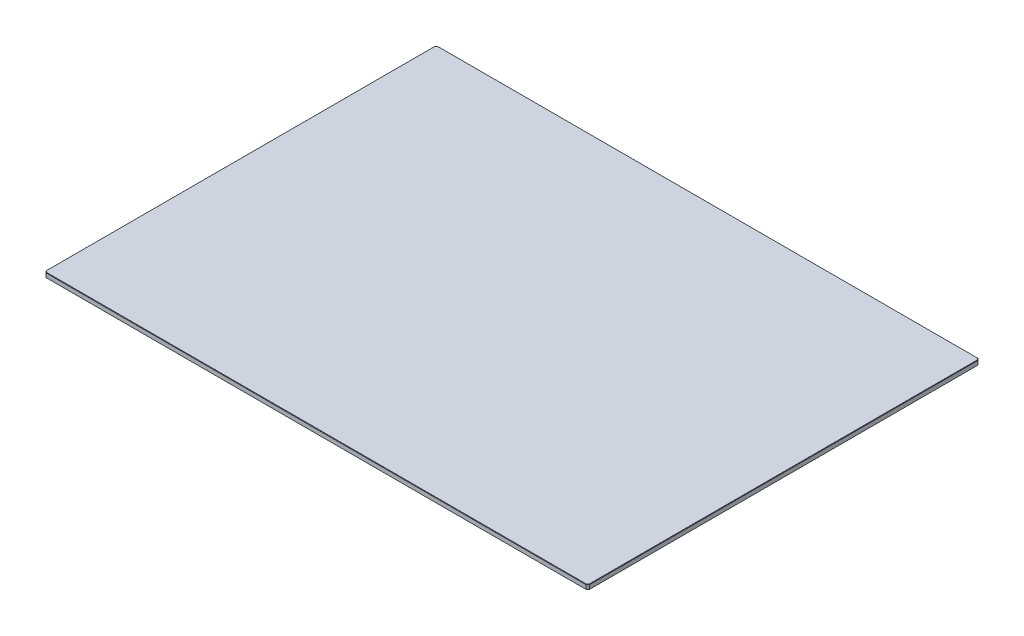
ISO-10303-21;
HEADER;
FILE_DESCRIPTION(('STEP AP214'),'2;1');
FILE_NAME('part.step','',(''),(''),'','','');
FILE_SCHEMA(('AUTOMOTIVE_DESIGN { 1 0 10303 214 1 1 1 1 }'));
ENDSEC;
DATA;
#1=APPLICATION_CONTEXT('core data for automotive mechanical design processes');
#2=APPLICATION_PROTOCOL_DEFINITION('international standard','automotive_design',2000,#1);
#3=PRODUCT_CONTEXT('',#1,'mechanical');
#4=PRODUCT('Part','Part','',(#3));
#5=PRODUCT_RELATED_PRODUCT_CATEGORY('part','',(#4));
#6=PRODUCT_DEFINITION_FORMATION('','',#4);
#7=PRODUCT_DEFINITION_CONTEXT('part definition',#1,'design');
#8=PRODUCT_DEFINITION('design','',#6,#7);
#9=PRODUCT_DEFINITION_SHAPE('','',#8);
#10=(LENGTH_UNIT() NAMED_UNIT(*) SI_UNIT(.MILLI.,.METRE.));
#11=(NAMED_UNIT(*) PLANE_ANGLE_UNIT() SI_UNIT($,.RADIAN.));
#12=(NAMED_UNIT(*) SI_UNIT($,.STERADIAN.) SOLID_ANGLE_UNIT());
#13=UNCERTAINTY_MEASURE_WITH_UNIT(LENGTH_MEASURE(1.E-05),#10,'distance_accuracy_value','');
#14=(GEOMETRIC_REPRESENTATION_CONTEXT(3) GLOBAL_UNCERTAINTY_ASSIGNED_CONTEXT((#13)) GLOBAL_UNIT_ASSIGNED_CONTEXT((#10,
#11,#12)) REPRESENTATION_CONTEXT('',''));
#15=CARTESIAN_POINT('',(0.,0.,0.));
#16=DIRECTION('',(0.,0.,1.));
#17=DIRECTION('',(1.,0.,0.));
#18=AXIS2_PLACEMENT_3D('',#15,#16,#17);
#19=CARTESIAN_POINT('',(0.,3.2,-1.14999999999998));
#20=DIRECTION('',(1.,0.,0.));
#21=DIRECTION('',(0.,0.,-1.));
#22=AXIS2_PLACEMENT_3D('',#19,#20,#21);
#23=PLANE('',#22);
#24=DIRECTION('',(0.,-1.,0.));
#25=VECTOR('',#24,1.);
#26=CARTESIAN_POINT('',(0.,3.2,-257.6125));
#27=LINE('',#26,#25);
#28=CARTESIAN_POINT('',(0.,2.94600000000008,-257.6125));
#29=VERTEX_POINT('',#28);
#30=CARTESIAN_POINT('',(0.,0.253999999999976,-257.6125));
#31=VERTEX_POINT('',#30);
#32=EDGE_CURVE('E265',#29,#31,#27,.T.);
#33=ORIENTED_EDGE('',*,*,#32,.T.);
#34=DIRECTION('',(0.,0.,1.));
#35=VECTOR('',#34,1.);
#36=CARTESIAN_POINT('',(0.,0.253999999999976,-1.14999999999998));
#37=LINE('',#36,#35);
#38=CARTESIAN_POINT('',(0.,0.253999999999976,-1.14999999999998));
#39=VERTEX_POINT('',#38);
#40=EDGE_CURVE('E230',#31,#39,#37,.T.);
#41=ORIENTED_EDGE('',*,*,#40,.T.);
#42=DIRECTION('',(0.,-1.,0.));
#43=VECTOR('',#42,1.);
#44=CARTESIAN_POINT('',(0.,3.2,-1.14999999999998));
#45=LINE('',#44,#43);
#46=CARTESIAN_POINT('',(0.,2.94600000000008,-1.14999999999998));
#47=VERTEX_POINT('',#46);
#48=EDGE_CURVE('E169',#47,#39,#45,.T.);
#49=ORIENTED_EDGE('',*,*,#48,.F.);
#50=DIRECTION('',(0.,0.,-1.));
#51=VECTOR('',#50,1.);
#52=CARTESIAN_POINT('',(0.,2.94600000000008,-1.14999999999998));
#53=LINE('',#52,#51);
#54=EDGE_CURVE('E228',#47,#29,#53,.T.);
#55=ORIENTED_EDGE('',*,*,#54,.T.);
#56=EDGE_LOOP('',(#33,#41,#49,#55));
#57=FACE_BOUND('',#56,.T.);
#58=ADVANCED_FACE('F33',(#57),#23,.F.);
#59=CARTESIAN_POINT('',(0.,3.2,-1.14999999999998));
#60=DIRECTION('',(0.707106781186543,0.,-0.707106781186552));
#61=DIRECTION('',(-0.707106781186552,0.,-0.707106781186543));
#62=AXIS2_PLACEMENT_3D('',#59,#60,#61);
#63=PLANE('',#62);
#64=ORIENTED_EDGE('',*,*,#48,.T.);
#65=DIRECTION('',(0.707106781186552,0.,0.707106781186543));
#66=VECTOR('',#65,1.);
#67=CARTESIAN_POINT('',(1.15,0.253999999999976,0.));
#68=LINE('',#67,#66);
#69=CARTESIAN_POINT('',(1.15,0.253999999999976,0.));
#70=VERTEX_POINT('',#69);
#71=EDGE_CURVE('E168',#39,#70,#68,.T.);
#72=ORIENTED_EDGE('',*,*,#71,.T.);
#73=DIRECTION('',(0.,-1.,0.));
#74=VECTOR('',#73,1.);
#75=CARTESIAN_POINT('',(1.15,3.2,0.));
#76=LINE('',#75,#74);
#77=CARTESIAN_POINT('',(1.15,2.94600000000008,0.));
#78=VERTEX_POINT('',#77);
#79=EDGE_CURVE('E150',#78,#70,#76,.T.);
#80=ORIENTED_EDGE('',*,*,#79,.F.);
#81=DIRECTION('',(-0.707106781186552,0.,-0.707106781186543));
#82=VECTOR('',#81,1.);
#83=CARTESIAN_POINT('',(0.,2.94600000000008,-1.14999999999998));
#84=LINE('',#83,#82);
#85=EDGE_CURVE('E165',#78,#47,#84,.T.);
#86=ORIENTED_EDGE('',*,*,#85,.T.);
#87=EDGE_LOOP('',(#64,#72,#80,#86));
#88=FACE_BOUND('',#87,.T.);
#89=ADVANCED_FACE('F163',(#88),#63,.F.);
#90=CARTESIAN_POINT('',(357.625,3.2,0.));
#91=DIRECTION('',(0.,0.,-1.));
#92=DIRECTION('',(-1.,0.,0.));
#93=AXIS2_PLACEMENT_3D('',#90,#91,#92);
#94=PLANE('',#93);
#95=ORIENTED_EDGE('',*,*,#79,.T.);
#96=DIRECTION('',(1.,0.,0.));
#97=VECTOR('',#96,1.);
#98=CARTESIAN_POINT('',(357.625,0.253999999999976,0.));
#99=LINE('',#98,#97);
#100=CARTESIAN_POINT('',(357.625,0.253999999999976,0.));
#101=VERTEX_POINT('',#100);
#102=EDGE_CURVE('E157',#70,#101,#99,.T.);
#103=ORIENTED_EDGE('',*,*,#102,.T.);
#104=DIRECTION('',(0.,-1.,0.));
#105=VECTOR('',#104,1.);
#106=CARTESIAN_POINT('',(357.625,3.2,0.));
#107=LINE('',#106,#105);
#108=CARTESIAN_POINT('',(357.625,2.94600000000008,0.));
#109=VERTEX_POINT('',#108);
#110=EDGE_CURVE('E152',#109,#101,#107,.T.);
#111=ORIENTED_EDGE('',*,*,#110,.F.);
#112=DIRECTION('',(-1.,0.,0.));
#113=VECTOR('',#112,1.);
#114=CARTESIAN_POINT('',(357.625,2.94600000000008,0.));
#115=LINE('',#114,#113);
#116=EDGE_CURVE('E147',#109,#78,#115,.T.);
#117=ORIENTED_EDGE('',*,*,#116,.T.);
#118=EDGE_LOOP('',(#95,#103,#111,#117));
#119=FACE_BOUND('',#118,.T.);
#120=ADVANCED_FACE('F149',(#119),#94,.F.);
#121=CARTESIAN_POINT('',(358.775,3.2,-1.14999999999998));
#122=DIRECTION('',(-0.70710678118653,0.,-0.707106781186565));
#123=DIRECTION('',(-0.707106781186565,0.,0.70710678118653));
#124=AXIS2_PLACEMENT_3D('',#121,#122,#123);
#125=PLANE('',#124);
#126=ORIENTED_EDGE('',*,*,#110,.T.);
#127=DIRECTION('',(0.707106781186565,0.,-0.70710678118653));
#128=VECTOR('',#127,1.);
#129=CARTESIAN_POINT('',(358.775,0.253999999999976,-1.14999999999998));
#130=LINE('',#129,#128);
#131=CARTESIAN_POINT('',(358.775,0.253999999999976,-1.14999999999998));
#132=VERTEX_POINT('',#131);
#133=EDGE_CURVE('E209',#101,#132,#130,.T.);
#134=ORIENTED_EDGE('',*,*,#133,.T.);
#135=DIRECTION('',(0.,-1.,0.));
#136=VECTOR('',#135,1.);
#137=CARTESIAN_POINT('',(358.775,3.2,-1.14999999999998));
#138=LINE('',#137,#136);
#139=CARTESIAN_POINT('',(358.775,2.94600000000008,-1.14999999999998));
#140=VERTEX_POINT('',#139);
#141=EDGE_CURVE('E290',#140,#132,#138,.T.);
#142=ORIENTED_EDGE('',*,*,#141,.F.);
#143=DIRECTION('',(-0.707106781186565,0.,0.70710678118653));
#144=VECTOR('',#143,1.);
#145=CARTESIAN_POINT('',(358.775,2.94600000000008,-1.14999999999998));
#146=LINE('',#145,#144);
#147=EDGE_CURVE('E207',#140,#109,#146,.T.);
#148=ORIENTED_EDGE('',*,*,#147,.T.);
#149=EDGE_LOOP('',(#126,#134,#142,#148));
#150=FACE_BOUND('',#149,.T.);
#151=ADVANCED_FACE('F287',(#150),#125,.F.);
#152=CARTESIAN_POINT('',(358.775,3.2,-257.6125));
#153=DIRECTION('',(-1.,0.,0.));
#154=DIRECTION('',(0.,0.,1.));
#155=AXIS2_PLACEMENT_3D('',#152,#153,#154);
#156=PLANE('',#155);
#157=ORIENTED_EDGE('',*,*,#141,.T.);
#158=DIRECTION('',(0.,0.,-1.));
#159=VECTOR('',#158,1.);
#160=CARTESIAN_POINT('',(358.775,0.253999999999976,-257.6125));
#161=LINE('',#160,#159);
#162=CARTESIAN_POINT('',(358.775,0.253999999999976,-257.6125));
#163=VERTEX_POINT('',#162);
#164=EDGE_CURVE('E213',#132,#163,#161,.T.);
#165=ORIENTED_EDGE('',*,*,#164,.T.);
#166=DIRECTION('',(0.,-1.,0.));
#167=VECTOR('',#166,1.);
#168=CARTESIAN_POINT('',(358.775,3.2,-257.6125));
#169=LINE('',#168,#167);
#170=CARTESIAN_POINT('',(358.775,2.94600000000008,-257.6125));
#171=VERTEX_POINT('',#170);
#172=EDGE_CURVE('E293',#171,#163,#169,.T.);
#173=ORIENTED_EDGE('',*,*,#172,.F.);
#174=DIRECTION('',(0.,0.,1.));
#175=VECTOR('',#174,1.);
#176=CARTESIAN_POINT('',(358.775,2.94600000000008,-257.6125));
#177=LINE('',#176,#175);
#178=EDGE_CURVE('E211',#171,#140,#177,.T.);
#179=ORIENTED_EDGE('',*,*,#178,.T.);
#180=EDGE_LOOP('',(#157,#165,#173,#179));
#181=FACE_BOUND('',#180,.T.);
#182=ADVANCED_FACE('F338',(#181),#156,.F.);
#183=CARTESIAN_POINT('',(358.775,3.2,-257.6125));
#184=DIRECTION('',(-0.70710678118653,0.,0.707106781186565));
#185=DIRECTION('',(0.707106781186565,0.,0.70710678118653));
#186=AXIS2_PLACEMENT_3D('',#183,#184,#185);
#187=PLANE('',#186);
#188=ORIENTED_EDGE('',*,*,#172,.T.);
#189=DIRECTION('',(-0.707106781186565,0.,-0.70710678118653));
#190=VECTOR('',#189,1.);
#191=CARTESIAN_POINT('',(357.625,0.253999999999976,-258.7625));
#192=LINE('',#191,#190);
#193=CARTESIAN_POINT('',(357.625,0.253999999999976,-258.7625));
#194=VERTEX_POINT('',#193);
#195=EDGE_CURVE('E217',#163,#194,#192,.T.);
#196=ORIENTED_EDGE('',*,*,#195,.T.);
#197=DIRECTION('',(0.,-1.,0.));
#198=VECTOR('',#197,1.);
#199=CARTESIAN_POINT('',(357.625,3.2,-258.7625));
#200=LINE('',#199,#198);
#201=CARTESIAN_POINT('',(357.625,2.94600000000008,-258.7625));
#202=VERTEX_POINT('',#201);
#203=EDGE_CURVE('E297',#202,#194,#200,.T.);
#204=ORIENTED_EDGE('',*,*,#203,.F.);
#205=DIRECTION('',(0.707106781186565,0.,0.70710678118653));
#206=VECTOR('',#205,1.);
#207=CARTESIAN_POINT('',(358.775,2.94600000000007,-257.6125));
#208=LINE('',#207,#206);
#209=EDGE_CURVE('E215',#202,#171,#208,.T.);
#210=ORIENTED_EDGE('',*,*,#209,.T.);
#211=EDGE_LOOP('',(#188,#196,#204,#210));
#212=FACE_BOUND('',#211,.T.);
#213=ADVANCED_FACE('F341',(#212),#187,.F.);
#214=CARTESIAN_POINT('',(1.15,3.2,-258.7625));
#215=DIRECTION('',(0.,0.,1.));
#216=DIRECTION('',(1.,0.,0.));
#217=AXIS2_PLACEMENT_3D('',#214,#215,#216);
#218=PLANE('',#217);
#219=ORIENTED_EDGE('',*,*,#203,.T.);
#220=DIRECTION('',(-1.,0.,0.));
#221=VECTOR('',#220,1.);
#222=CARTESIAN_POINT('',(1.15,0.253999999999976,-258.7625));
#223=LINE('',#222,#221);
#224=CARTESIAN_POINT('',(1.15,0.253999999999976,-258.7625));
#225=VERTEX_POINT('',#224);
#226=EDGE_CURVE('E221',#194,#225,#223,.T.);
#227=ORIENTED_EDGE('',*,*,#226,.T.);
#228=DIRECTION('',(0.,-1.,0.));
#229=VECTOR('',#228,1.);
#230=CARTESIAN_POINT('',(1.15,3.2,-258.7625));
#231=LINE('',#230,#229);
#232=CARTESIAN_POINT('',(1.15,2.94600000000008,-258.7625));
#233=VERTEX_POINT('',#232);
#234=EDGE_CURVE('E302',#233,#225,#231,.T.);
#235=ORIENTED_EDGE('',*,*,#234,.F.);
#236=DIRECTION('',(1.,0.,0.));
#237=VECTOR('',#236,1.);
#238=CARTESIAN_POINT('',(1.15,2.94600000000008,-258.7625));
#239=LINE('',#238,#237);
#240=EDGE_CURVE('E219',#233,#202,#239,.T.);
#241=ORIENTED_EDGE('',*,*,#240,.T.);
#242=EDGE_LOOP('',(#219,#227,#235,#241));
#243=FACE_BOUND('',#242,.T.);
#244=ADVANCED_FACE('F355',(#243),#218,.F.);
#245=CARTESIAN_POINT('',(0.,3.2,-257.6125));
#246=DIRECTION('',(0.707106781186543,0.,0.707106781186552));
#247=DIRECTION('',(0.707106781186552,0.,-0.707106781186543));
#248=AXIS2_PLACEMENT_3D('',#245,#246,#247);
#249=PLANE('',#248);
#250=ORIENTED_EDGE('',*,*,#234,.T.);
#251=DIRECTION('',(-0.707106781186552,0.,0.707106781186543));
#252=VECTOR('',#251,1.);
#253=CARTESIAN_POINT('',(0.,0.253999999999976,-257.6125));
#254=LINE('',#253,#252);
#255=EDGE_CURVE('E226',#225,#31,#254,.T.);
#256=ORIENTED_EDGE('',*,*,#255,.T.);
#257=ORIENTED_EDGE('',*,*,#32,.F.);
#258=DIRECTION('',(0.707106781186552,0.,-0.707106781186543));
#259=VECTOR('',#258,1.);
#260=CARTESIAN_POINT('',(0.,2.94600000000009,-257.6125));
#261=LINE('',#260,#259);
#262=EDGE_CURVE('E223',#29,#233,#261,.T.);
#263=ORIENTED_EDGE('',*,*,#262,.T.);
#264=EDGE_LOOP('',(#250,#256,#257,#263));
#265=FACE_BOUND('',#264,.T.);
#266=ADVANCED_FACE('F356',(#265),#249,.F.);
#267=CARTESIAN_POINT('',(0.,3.2,0.));
#268=DIRECTION('',(0.,-1.,0.));
#269=DIRECTION('',(0.,0.,-1.));
#270=AXIS2_PLACEMENT_3D('',#267,#268,#269);
#271=PLANE('',#270);
#272=DIRECTION('',(-1.,0.,0.));
#273=VECTOR('',#272,1.);
#274=CARTESIAN_POINT('',(0.,3.2,-258.5085));
#275=LINE('',#274,#273);
#276=CARTESIAN_POINT('',(357.519789755157,3.2,-258.5085));
#277=VERTEX_POINT('',#276);
#278=CARTESIAN_POINT('',(1.25521024484277,3.2,-258.5085));
#279=VERTEX_POINT('',#278);
#280=EDGE_CURVE('E42',#277,#279,#275,.T.);
#281=ORIENTED_EDGE('',*,*,#280,.T.);
#282=DIRECTION('',(-0.707106781186552,0.,0.707106781186543));
#283=VECTOR('',#282,1.);
#284=CARTESIAN_POINT('',(-128.626644877579,3.2,-128.62664487758));
#285=LINE('',#284,#283);
#286=CARTESIAN_POINT('',(0.253999999999976,3.2,-257.507289755157));
#287=VERTEX_POINT('',#286);
#288=EDGE_CURVE('E11',#279,#287,#285,.T.);
#289=ORIENTED_EDGE('',*,*,#288,.T.);
#290=DIRECTION('',(0.,0.,1.));
#291=VECTOR('',#290,1.);
#292=CARTESIAN_POINT('',(0.253999999999976,3.2,0.));
#293=LINE('',#292,#291);
#294=CARTESIAN_POINT('',(0.253999999999976,3.2,-1.25521024484274));
#295=VERTEX_POINT('',#294);
#296=EDGE_CURVE('E232',#287,#295,#293,.T.);
#297=ORIENTED_EDGE('',*,*,#296,.T.);
#298=DIRECTION('',(0.707106781186552,0.,0.707106781186543));
#299=VECTOR('',#298,1.);
#300=CARTESIAN_POINT('',(0.754605122421357,3.2,-0.754605122421367));
#301=LINE('',#300,#299);
#302=CARTESIAN_POINT('',(1.25521024484275,3.2,-0.253999999999976));
#303=VERTEX_POINT('',#302);
#304=EDGE_CURVE('E234',#295,#303,#301,.T.);
#305=ORIENTED_EDGE('',*,*,#304,.T.);
#306=DIRECTION('',(1.,0.,0.));
#307=VECTOR('',#306,1.);
#308=CARTESIAN_POINT('',(0.,3.2,-0.253999999999976));
#309=LINE('',#308,#307);
#310=CARTESIAN_POINT('',(357.519789755157,3.2,-0.253999999999976));
#311=VERTEX_POINT('',#310);
#312=EDGE_CURVE('E175',#303,#311,#309,.T.);
#313=ORIENTED_EDGE('',*,*,#312,.T.);
#314=DIRECTION('',(0.707106781186565,0.,-0.70710678118653));
#315=VECTOR('',#314,1.);
#316=CARTESIAN_POINT('',(178.63289487757,3.2,178.632894877579));
#317=LINE('',#316,#315);
#318=CARTESIAN_POINT('',(358.521,3.2,-1.25521024484277));
#319=VERTEX_POINT('',#318);
#320=EDGE_CURVE('E237',#311,#319,#317,.T.);
#321=ORIENTED_EDGE('',*,*,#320,.T.);
#322=DIRECTION('',(0.,0.,-1.));
#323=VECTOR('',#322,1.);
#324=CARTESIAN_POINT('',(358.521,3.2,0.));
#325=LINE('',#324,#323);
#326=CARTESIAN_POINT('',(358.521,3.2,-257.507289755157));
#327=VERTEX_POINT('',#326);
#328=EDGE_CURVE('E239',#319,#327,#325,.T.);
#329=ORIENTED_EDGE('',*,*,#328,.T.);
#330=DIRECTION('',(-0.707106781186565,0.,-0.70710678118653));
#331=VECTOR('',#330,1.);
#332=CARTESIAN_POINT('',(308.01414487757,3.2,-308.014144877585));
#333=LINE('',#332,#331);
#334=EDGE_CURVE('E53',#327,#277,#333,.T.);
#335=ORIENTED_EDGE('',*,*,#334,.T.);
#336=EDGE_LOOP('',(#281,#289,#297,#305,#313,#321,#329,#335));
#337=FACE_BOUND('',#336,.T.);
#338=ADVANCED_FACE('F365',(#337),#271,.F.);
#339=CARTESIAN_POINT('',(0.,0.,0.));
#340=DIRECTION('',(0.,-1.,0.));
#341=DIRECTION('',(0.,0.,-1.));
#342=AXIS2_PLACEMENT_3D('',#339,#340,#341);
#343=PLANE('',#342);
#344=DIRECTION('',(-1.,0.,0.));
#345=VECTOR('',#344,1.);
#346=CARTESIAN_POINT('',(1.15,0.,-0.253999999999921));
#347=LINE('',#346,#345);
#348=CARTESIAN_POINT('',(357.519789755157,0.,-0.253999999999932));
#349=VERTEX_POINT('',#348);
#350=CARTESIAN_POINT('',(1.25521024484273,0.,-0.253999999999921));
#351=VERTEX_POINT('',#350);
#352=EDGE_CURVE('E202',#349,#351,#347,.T.);
#353=ORIENTED_EDGE('',*,*,#352,.T.);
#354=DIRECTION('',(-0.707106781186552,0.,-0.707106781186543));
#355=VECTOR('',#354,1.);
#356=CARTESIAN_POINT('',(0.179605122421326,0.,-1.32960512242131));
#357=LINE('',#356,#355);
#358=CARTESIAN_POINT('',(0.253999999999921,0.,-1.25521024484272));
#359=VERTEX_POINT('',#358);
#360=EDGE_CURVE('E158',#351,#359,#357,.T.);
#361=ORIENTED_EDGE('',*,*,#360,.T.);
#362=DIRECTION('',(0.,0.,-1.));
#363=VECTOR('',#362,1.);
#364=CARTESIAN_POINT('',(0.253999999999921,0.,-257.6125));
#365=LINE('',#364,#363);
#366=CARTESIAN_POINT('',(0.253999999999921,0.,-257.507289755157));
#367=VERTEX_POINT('',#366);
#368=EDGE_CURVE('E187',#359,#367,#365,.T.);
#369=ORIENTED_EDGE('',*,*,#368,.T.);
#370=DIRECTION('',(0.707106781186552,0.,-0.707106781186543));
#371=VECTOR('',#370,1.);
#372=CARTESIAN_POINT('',(1.32960512242132,0.,-258.582894877579));
#373=LINE('',#372,#371);
#374=CARTESIAN_POINT('',(1.25521024484272,0.,-258.5085));
#375=VERTEX_POINT('',#374);
#376=EDGE_CURVE('E192',#367,#375,#373,.T.);
#377=ORIENTED_EDGE('',*,*,#376,.T.);
#378=DIRECTION('',(1.,0.,0.));
#379=VECTOR('',#378,1.);
#380=CARTESIAN_POINT('',(357.625,0.,-258.5085));
#381=LINE('',#380,#379);
#382=CARTESIAN_POINT('',(357.519789755157,0.,-258.5085));
#383=VERTEX_POINT('',#382);
#384=EDGE_CURVE('E194',#375,#383,#381,.T.);
#385=ORIENTED_EDGE('',*,*,#384,.T.);
#386=DIRECTION('',(0.707106781186565,0.,0.70710678118653));
#387=VECTOR('',#386,1.);
#388=CARTESIAN_POINT('',(358.595394877579,0.,-257.432894877579));
#389=LINE('',#388,#387);
#390=CARTESIAN_POINT('',(358.521,0.,-257.507289755157));
#391=VERTEX_POINT('',#390);
#392=EDGE_CURVE('E196',#383,#391,#389,.T.);
#393=ORIENTED_EDGE('',*,*,#392,.T.);
#394=DIRECTION('',(0.,0.,1.));
#395=VECTOR('',#394,1.);
#396=CARTESIAN_POINT('',(358.521,0.,-1.14999999999998));
#397=LINE('',#396,#395);
#398=CARTESIAN_POINT('',(358.521,0.,-1.25521024484263));
#399=VERTEX_POINT('',#398);
#400=EDGE_CURVE('E198',#391,#399,#397,.T.);
#401=ORIENTED_EDGE('',*,*,#400,.T.);
#402=DIRECTION('',(-0.707106781186565,0.,0.70710678118653));
#403=VECTOR('',#402,1.);
#404=CARTESIAN_POINT('',(357.445394877579,0.,-0.179605122421292));
#405=LINE('',#404,#403);
#406=EDGE_CURVE('E200',#399,#349,#405,.T.);
#407=ORIENTED_EDGE('',*,*,#406,.T.);
#408=EDGE_LOOP('',(#353,#361,#369,#377,#385,#393,#401,#407));
#409=FACE_BOUND('',#408,.T.);
#410=ADVANCED_FACE('F367',(#409),#343,.T.);
#411=CARTESIAN_POINT('',(358.775,0.253999999999976,-257.6125));
#412=DIRECTION('',(0.50000000000009,-0.707106781186403,-0.500000000000115));
#413=DIRECTION('',(0.707106781186565,0.,0.70710678118653));
#414=AXIS2_PLACEMENT_3D('',#411,#412,#413);
#415=PLANE('',#414);
#416=DIRECTION('',(-0.678598344545812,-0.67859834454596,0.281084637714632));
#417=VECTOR('',#416,1.);
#418=CARTESIAN_POINT('',(358.775,0.253999999999976,-257.6125));
#419=LINE('',#418,#417);
#420=EDGE_CURVE('E259',#391,#163,#419,.F.);
#421=ORIENTED_EDGE('',*,*,#420,.F.);
#422=ORIENTED_EDGE('',*,*,#392,.F.);
#423=DIRECTION('',(-0.281084637714614,-0.678598344545964,0.678598344545816));
#424=VECTOR('',#423,1.);
#425=CARTESIAN_POINT('',(329.4604187405,-67.7413140553058,-190.767185944709));
#426=LINE('',#425,#424);
#427=EDGE_CURVE('E262',#194,#383,#426,.T.);
#428=ORIENTED_EDGE('',*,*,#427,.F.);
#429=ORIENTED_EDGE('',*,*,#195,.F.);
#430=EDGE_LOOP('',(#421,#422,#428,#429));
#431=FACE_BOUND('',#430,.T.);
#432=ADVANCED_FACE('F346',(#431),#415,.T.);
#433=CARTESIAN_POINT('',(1.15,0.253999999999976,-258.7625));
#434=DIRECTION('',(0.,-0.70710678118647,-0.707106781186625));
#435=DIRECTION('',(1.,0.,0.));
#436=AXIS2_PLACEMENT_3D('',#433,#434,#435);
#437=PLANE('',#436);
#438=ORIENTED_EDGE('',*,*,#427,.T.);
#439=ORIENTED_EDGE('',*,*,#384,.F.);
#440=DIRECTION('',(0.281084637714741,-0.678598344545938,0.678598344545789));
#441=VECTOR('',#440,1.);
#442=CARTESIAN_POINT('',(1.27849524571193,-0.0562149648983651,-258.452285035102));
#443=LINE('',#442,#441);
#444=EDGE_CURVE('E256',#225,#375,#443,.T.);
#445=ORIENTED_EDGE('',*,*,#444,.F.);
#446=ORIENTED_EDGE('',*,*,#226,.F.);
#447=EDGE_LOOP('',(#438,#439,#445,#446));
#448=FACE_BOUND('',#447,.T.);
#449=ADVANCED_FACE('F352',(#448),#437,.T.);
#450=CARTESIAN_POINT('',(358.775,0.253999999999976,-257.6125));
#451=DIRECTION('',(0.707106781186625,-0.70710678118647,0.));
#452=DIRECTION('',(0.,0.,1.));
#453=AXIS2_PLACEMENT_3D('',#450,#451,#452);
#454=PLANE('',#453);
#455=ORIENTED_EDGE('',*,*,#420,.T.);
#456=ORIENTED_EDGE('',*,*,#164,.F.);
#457=DIRECTION('',(-0.678598344545817,-0.678598344545965,-0.281084637714608));
#458=VECTOR('',#457,1.);
#459=CARTESIAN_POINT('',(309.856427222373,-48.664572777638,-21.4127362964141));
#460=LINE('',#459,#458);
#461=EDGE_CURVE('E253',#399,#132,#460,.F.);
#462=ORIENTED_EDGE('',*,*,#461,.F.);
#463=ORIENTED_EDGE('',*,*,#400,.F.);
#464=EDGE_LOOP('',(#455,#456,#462,#463));
#465=FACE_BOUND('',#464,.T.);
#466=ADVANCED_FACE('F335',(#465),#454,.T.);
#467=CARTESIAN_POINT('',(0.,0.253999999999976,-257.6125));
#468=DIRECTION('',(-0.500000000000065,-0.707106781186451,-0.500000000000072));
#469=DIRECTION('',(0.707106781186552,0.,-0.707106781186543));
#470=AXIS2_PLACEMENT_3D('',#467,#468,#469);
#471=PLANE('',#470);
#472=ORIENTED_EDGE('',*,*,#444,.T.);
#473=ORIENTED_EDGE('',*,*,#376,.F.);
#474=DIRECTION('',(0.678598344545788,-0.678598344545937,0.281084637714746));
#475=VECTOR('',#474,1.);
#476=CARTESIAN_POINT('',(48.9185727776493,-48.66457277766,-237.349763703566));
#477=LINE('',#476,#475);
#478=EDGE_CURVE('E250',#31,#367,#477,.T.);
#479=ORIENTED_EDGE('',*,*,#478,.F.);
#480=ORIENTED_EDGE('',*,*,#255,.F.);
#481=EDGE_LOOP('',(#472,#473,#479,#480));
#482=FACE_BOUND('',#481,.T.);
#483=ADVANCED_FACE('F315',(#482),#471,.T.);
#484=CARTESIAN_POINT('',(358.775,0.253999999999976,-1.14999999999998));
#485=DIRECTION('',(0.500000000000097,-0.707106781186393,0.500000000000121));
#486=DIRECTION('',(-0.707106781186565,0.,0.70710678118653));
#487=AXIS2_PLACEMENT_3D('',#484,#485,#486);
#488=PLANE('',#487);
#489=ORIENTED_EDGE('',*,*,#461,.T.);
#490=ORIENTED_EDGE('',*,*,#133,.F.);
#491=DIRECTION('',(-0.28108463771459,-0.678598344545969,-0.678598344545821));
#492=VECTOR('',#491,1.);
#493=CARTESIAN_POINT('',(357.496504754288,-0.0562149648985142,-0.310214964898423));
#494=LINE('',#493,#492);
#495=EDGE_CURVE('E247',#349,#101,#494,.F.);
#496=ORIENTED_EDGE('',*,*,#495,.F.);
#497=ORIENTED_EDGE('',*,*,#406,.F.);
#498=EDGE_LOOP('',(#489,#490,#496,#497));
#499=FACE_BOUND('',#498,.T.);
#500=ADVANCED_FACE('F331',(#499),#488,.T.);
#501=CARTESIAN_POINT('',(0.,0.253999999999976,-1.14999999999998));
#502=DIRECTION('',(-0.707106781186625,-0.70710678118647,0.));
#503=DIRECTION('',(0.,0.,-1.));
#504=AXIS2_PLACEMENT_3D('',#501,#502,#503);
#505=PLANE('',#504);
#506=ORIENTED_EDGE('',*,*,#478,.T.);
#507=ORIENTED_EDGE('',*,*,#368,.F.);
#508=DIRECTION('',(-0.678598344545778,0.678598344545927,0.281084637714794));
#509=VECTOR('',#508,1.);
#510=CARTESIAN_POINT('',(0.,0.253999999999976,-1.14999999999998));
#511=LINE('',#510,#509);
#512=EDGE_CURVE('E245',#39,#359,#511,.F.);
#513=ORIENTED_EDGE('',*,*,#512,.F.);
#514=ORIENTED_EDGE('',*,*,#40,.F.);
#515=EDGE_LOOP('',(#506,#507,#513,#514));
#516=FACE_BOUND('',#515,.T.);
#517=ADVANCED_FACE('F319',(#516),#505,.T.);
#518=CARTESIAN_POINT('',(357.625,0.253999999999976,0.));
#519=DIRECTION('',(0.,-0.70710678118647,0.707106781186625));
#520=DIRECTION('',(-1.,0.,0.));
#521=AXIS2_PLACEMENT_3D('',#518,#519,#520);
#522=PLANE('',#521);
#523=ORIENTED_EDGE('',*,*,#495,.T.);
#524=ORIENTED_EDGE('',*,*,#102,.F.);
#525=DIRECTION('',(0.281084637714789,-0.678598344545928,-0.678598344545779));
#526=VECTOR('',#525,1.);
#527=CARTESIAN_POINT('',(29.3145812595351,-67.7413140553444,-67.9953140553295));
#528=LINE('',#527,#526);
#529=EDGE_CURVE('E243',#351,#70,#528,.F.);
#530=ORIENTED_EDGE('',*,*,#529,.F.);
#531=ORIENTED_EDGE('',*,*,#352,.F.);
#532=EDGE_LOOP('',(#523,#524,#530,#531));
#533=FACE_BOUND('',#532,.T.);
#534=ADVANCED_FACE('F327',(#533),#522,.T.);
#535=CARTESIAN_POINT('',(0.,0.253999999999976,-1.14999999999998));
#536=DIRECTION('',(-0.500000000000052,-0.70710678118647,0.500000000000058));
#537=DIRECTION('',(-0.707106781186552,0.,-0.707106781186543));
#538=AXIS2_PLACEMENT_3D('',#535,#536,#537);
#539=PLANE('',#538);
#540=ORIENTED_EDGE('',*,*,#512,.T.);
#541=ORIENTED_EDGE('',*,*,#360,.F.);
#542=ORIENTED_EDGE('',*,*,#529,.T.);
#543=ORIENTED_EDGE('',*,*,#71,.F.);
#544=EDGE_LOOP('',(#540,#541,#542,#543));
#545=FACE_BOUND('',#544,.T.);
#546=ADVANCED_FACE('F322',(#545),#539,.T.);
#547=CARTESIAN_POINT('',(178.63289487757,3.2,178.632894877579));
#548=DIRECTION('',(-0.499999999999906,-0.707106781186663,-0.49999999999993));
#549=DIRECTION('',(0.707106781186565,0.,-0.70710678118653));
#550=AXIS2_PLACEMENT_3D('',#547,#548,#549);
#551=PLANE('',#550);
#552=DIRECTION('',(-0.281084637714936,0.678598344545749,-0.678598344545897));
#553=VECTOR('',#552,1.);
#554=CARTESIAN_POINT('',(329.272661147368,71.3946009829833,-68.4486009829982));
#555=LINE('',#554,#553);
#556=EDGE_CURVE('E274',#109,#311,#555,.T.);
#557=ORIENTED_EDGE('',*,*,#556,.F.);
#558=ORIENTED_EDGE('',*,*,#147,.F.);
#559=DIRECTION('',(-0.678598344545894,0.678598344545745,-0.281084637714954));
#560=VECTOR('',#559,1.);
#561=CARTESIAN_POINT('',(309.995798072897,51.7252019270921,-21.3550069999499));
#562=LINE('',#561,#560);
#563=EDGE_CURVE('E37',#319,#140,#562,.F.);
#564=ORIENTED_EDGE('',*,*,#563,.F.);
#565=ORIENTED_EDGE('',*,*,#320,.F.);
#566=EDGE_LOOP('',(#557,#558,#564,#565));
#567=FACE_BOUND('',#566,.T.);
#568=ADVANCED_FACE('F35',(#567),#551,.F.);
#569=CARTESIAN_POINT('',(358.521,3.2,0.));
#570=DIRECTION('',(-0.70710678118647,-0.707106781186625,0.));
#571=DIRECTION('',(0.,0.,-1.));
#572=AXIS2_PLACEMENT_3D('',#569,#570,#571);
#573=PLANE('',#572);
#574=ORIENTED_EDGE('',*,*,#563,.T.);
#575=ORIENTED_EDGE('',*,*,#178,.F.);
#576=DIRECTION('',(-0.678598344545964,0.678598344545815,0.281084637714616));
#577=VECTOR('',#576,1.);
#578=CARTESIAN_POINT('',(309.40314029474,52.3178597052495,-237.162006110518));
#579=LINE('',#578,#577);
#580=EDGE_CURVE('E178',#327,#171,#579,.F.);
#581=ORIENTED_EDGE('',*,*,#580,.F.);
#582=ORIENTED_EDGE('',*,*,#328,.F.);
#583=EDGE_LOOP('',(#574,#575,#581,#582));
#584=FACE_BOUND('',#583,.T.);
#585=ADVANCED_FACE('F280',(#584),#573,.F.);
#586=CARTESIAN_POINT('',(0.,3.2,-0.253999999999976));
#587=DIRECTION('',(0.,-0.707106781186625,-0.70710678118647));
#588=DIRECTION('',(1.,0.,0.));
#589=AXIS2_PLACEMENT_3D('',#586,#587,#588);
#590=PLANE('',#589);
#591=ORIENTED_EDGE('',*,*,#556,.T.);
#592=ORIENTED_EDGE('',*,*,#312,.F.);
#593=DIRECTION('',(0.281084637714845,0.678598344545768,-0.678598344545916));
#594=VECTOR('',#593,1.);
#595=CARTESIAN_POINT('',(1.3111453563299,3.33503930476509,-0.389039304765096));
#596=LINE('',#595,#594);
#597=EDGE_CURVE('E173',#78,#303,#596,.T.);
#598=ORIENTED_EDGE('',*,*,#597,.F.);
#599=ORIENTED_EDGE('',*,*,#116,.F.);
#600=EDGE_LOOP('',(#591,#592,#598,#599));
#601=FACE_BOUND('',#600,.T.);
#602=ADVANCED_FACE('F174',(#601),#590,.F.);
#603=CARTESIAN_POINT('',(308.01414487757,3.2,-308.014144877585));
#604=DIRECTION('',(-0.500000000000002,-0.707106781186528,0.500000000000026));
#605=DIRECTION('',(-0.707106781186565,0.,-0.70710678118653));
#606=AXIS2_PLACEMENT_3D('',#603,#604,#605);
#607=PLANE('',#606);
#608=ORIENTED_EDGE('',*,*,#580,.T.);
#609=ORIENTED_EDGE('',*,*,#209,.F.);
#610=DIRECTION('',(-0.281084637714598,0.678598344545819,0.678598344545967));
#611=VECTOR('',#610,1.);
#612=CARTESIAN_POINT('',(363.051302800961,-10.1542538156342,-271.862753815637));
#613=LINE('',#612,#611);
#614=EDGE_CURVE('E179',#277,#202,#613,.F.);
#615=ORIENTED_EDGE('',*,*,#614,.F.);
#616=ORIENTED_EDGE('',*,*,#334,.F.);
#617=EDGE_LOOP('',(#608,#609,#615,#616));
#618=FACE_BOUND('',#617,.T.);
#619=ADVANCED_FACE('F410',(#618),#607,.F.);
#620=CARTESIAN_POINT('',(0.754605122421357,3.2,-0.754605122421367));
#621=DIRECTION('',(0.499999999999942,-0.707106781186625,-0.499999999999949));
#622=DIRECTION('',(0.707106781186552,0.,0.707106781186543));
#623=AXIS2_PLACEMENT_3D('',#620,#621,#622);
#624=PLANE('',#623);
#625=ORIENTED_EDGE('',*,*,#597,.T.);
#626=ORIENTED_EDGE('',*,*,#304,.F.);
#627=DIRECTION('',(0.678598344545915,0.678598344545767,-0.28108463771485));
#628=VECTOR('',#627,1.);
#629=CARTESIAN_POINT('',(0.0145767170107484,2.96057671701082,-1.15603787388071));
#630=LINE('',#629,#628);
#631=EDGE_CURVE('E184',#47,#295,#630,.T.);
#632=ORIENTED_EDGE('',*,*,#631,.F.);
#633=ORIENTED_EDGE('',*,*,#85,.F.);
#634=EDGE_LOOP('',(#625,#626,#632,#633));
#635=FACE_BOUND('',#634,.T.);
#636=ADVANCED_FACE('F182',(#635),#624,.F.);
#637=CARTESIAN_POINT('',(0.,3.2,-258.5085));
#638=DIRECTION('',(0.,-0.707106781186625,0.70710678118647));
#639=DIRECTION('',(-1.,0.,0.));
#640=AXIS2_PLACEMENT_3D('',#637,#638,#639);
#641=PLANE('',#640);
#642=ORIENTED_EDGE('',*,*,#614,.T.);
#643=ORIENTED_EDGE('',*,*,#240,.F.);
#644=DIRECTION('',(0.281084637714943,0.678598344545747,0.678598344545896));
#645=VECTOR('',#644,1.);
#646=CARTESIAN_POINT('',(1.15603787388068,2.96057671701074,-258.747923282989));
#647=LINE('',#646,#645);
#648=EDGE_CURVE('E268',#279,#233,#647,.F.);
#649=ORIENTED_EDGE('',*,*,#648,.F.);
#650=ORIENTED_EDGE('',*,*,#280,.F.);
#651=EDGE_LOOP('',(#642,#643,#649,#650));
#652=FACE_BOUND('',#651,.T.);
#653=ADVANCED_FACE('F404',(#652),#641,.F.);
#654=CARTESIAN_POINT('',(0.253999999999976,3.2,0.));
#655=DIRECTION('',(0.70710678118647,-0.707106781186625,0.));
#656=DIRECTION('',(0.,0.,1.));
#657=AXIS2_PLACEMENT_3D('',#654,#655,#656);
#658=PLANE('',#657);
#659=ORIENTED_EDGE('',*,*,#631,.T.);
#660=ORIENTED_EDGE('',*,*,#296,.F.);
#661=DIRECTION('',(-0.678598344545895,-0.678598344545747,-0.281084637714948));
#662=VECTOR('',#661,1.);
#663=CARTESIAN_POINT('',(49.3718597053132,52.3178597053025,-237.16200611047));
#664=LINE('',#663,#662);
#665=EDGE_CURVE('E266',#29,#287,#664,.F.);
#666=ORIENTED_EDGE('',*,*,#665,.F.);
#667=ORIENTED_EDGE('',*,*,#54,.F.);
#668=EDGE_LOOP('',(#659,#660,#666,#667));
#669=FACE_BOUND('',#668,.T.);
#670=ADVANCED_FACE('F364',(#669),#658,.F.);
#671=CARTESIAN_POINT('',(-128.626644877579,3.2,-128.62664487758));
#672=DIRECTION('',(0.499999999999915,-0.707106781186663,0.499999999999921));
#673=DIRECTION('',(-0.707106781186552,0.,0.707106781186543));
#674=AXIS2_PLACEMENT_3D('',#671,#672,#673);
#675=PLANE('',#674);
#676=ORIENTED_EDGE('',*,*,#648,.T.);
#677=ORIENTED_EDGE('',*,*,#262,.F.);
#678=ORIENTED_EDGE('',*,*,#665,.T.);
#679=ORIENTED_EDGE('',*,*,#288,.F.);
#680=EDGE_LOOP('',(#676,#677,#678,#679));
#681=FACE_BOUND('',#680,.T.);
#682=ADVANCED_FACE('F359',(#681),#675,.F.);
#683=CLOSED_SHELL('',(#58,#89,#120,#151,#182,#213,#244,#266,#338,#410,#432,#449,#466,#483,#500,
#517,#534,#546,#568,#585,#602,#619,#636,#653,#670,#682));
#684=MANIFOLD_SOLID_BREP('B2',#683);
#685=ADVANCED_BREP_SHAPE_REPRESENTATION('',(#18,#684),#14);
#686=SHAPE_DEFINITION_REPRESENTATION(#9,#685);
ENDSEC;
END-ISO-10303-21;
